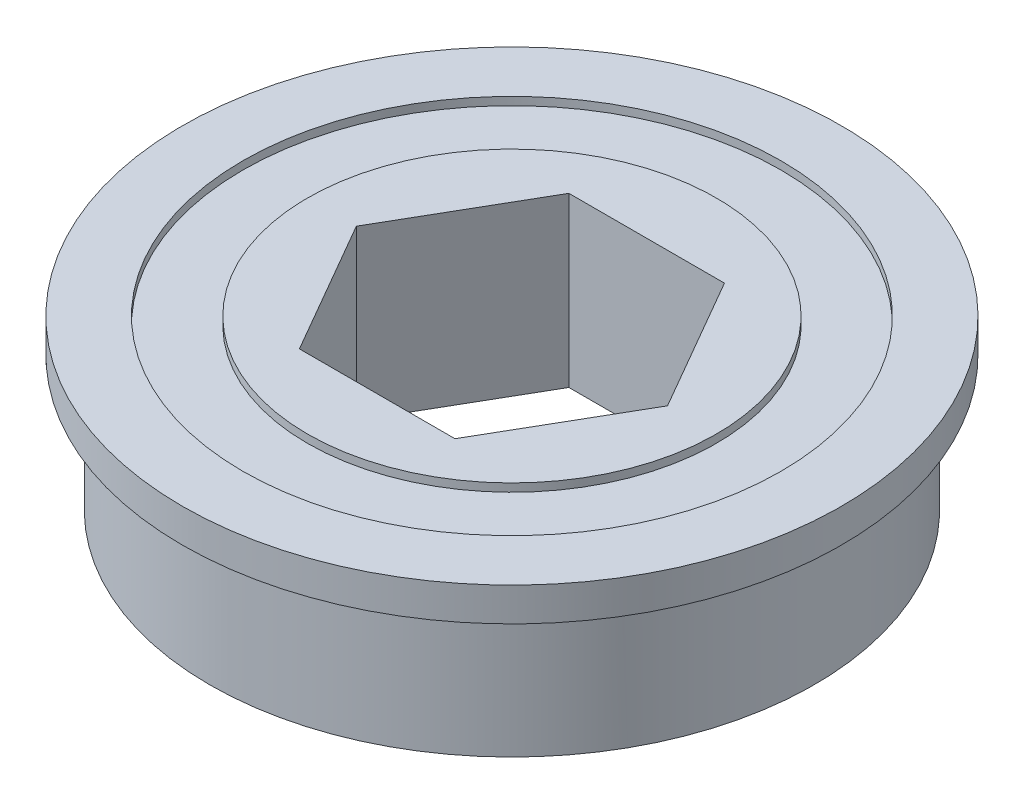
ISO-10303-21;
HEADER;
FILE_DESCRIPTION(('STEP AP214'),'2;1');
FILE_NAME('part.step','',(''),(''),'','','');
FILE_SCHEMA(('AUTOMOTIVE_DESIGN { 1 0 10303 214 1 1 1 1 }'));
ENDSEC;
DATA;
#1=APPLICATION_CONTEXT('core data for automotive mechanical design processes');
#2=APPLICATION_PROTOCOL_DEFINITION('international standard','automotive_design',2000,#1);
#3=PRODUCT_CONTEXT('',#1,'mechanical');
#4=PRODUCT('Part','Part','',(#3));
#5=PRODUCT_RELATED_PRODUCT_CATEGORY('part','',(#4));
#6=PRODUCT_DEFINITION_FORMATION('','',#4);
#7=PRODUCT_DEFINITION_CONTEXT('part definition',#1,'design');
#8=PRODUCT_DEFINITION('design','',#6,#7);
#9=PRODUCT_DEFINITION_SHAPE('','',#8);
#10=(LENGTH_UNIT() NAMED_UNIT(*) SI_UNIT(.MILLI.,.METRE.));
#11=(NAMED_UNIT(*) PLANE_ANGLE_UNIT() SI_UNIT($,.RADIAN.));
#12=(NAMED_UNIT(*) SI_UNIT($,.STERADIAN.) SOLID_ANGLE_UNIT());
#13=UNCERTAINTY_MEASURE_WITH_UNIT(LENGTH_MEASURE(1.E-05),#10,'distance_accuracy_value','');
#14=(GEOMETRIC_REPRESENTATION_CONTEXT(3) GLOBAL_UNCERTAINTY_ASSIGNED_CONTEXT((#13)) GLOBAL_UNIT_ASSIGNED_CONTEXT((#10,
#11,#12)) REPRESENTATION_CONTEXT('',''));
#15=CARTESIAN_POINT('',(0.,0.,0.));
#16=DIRECTION('',(0.,0.,1.));
#17=DIRECTION('',(1.,0.,0.));
#18=AXIS2_PLACEMENT_3D('',#15,#16,#17);
#19=CARTESIAN_POINT('',(0.,0.,0.));
#20=DIRECTION('',(0.,1.,0.));
#21=DIRECTION('',(0.,0.,1.));
#22=AXIS2_PLACEMENT_3D('',#19,#20,#21);
#23=CYLINDRICAL_SURFACE('',#22,12.7);
#24=CARTESIAN_POINT('',(0.,0.381,0.));
#25=DIRECTION('',(0.,1.,0.));
#26=DIRECTION('',(0.,0.,1.));
#27=AXIS2_PLACEMENT_3D('',#24,#25,#26);
#28=CIRCLE('',#27,12.7);
#29=CARTESIAN_POINT('',(0.,0.381,12.7));
#30=VERTEX_POINT('',#29);
#31=EDGE_CURVE('E180',#30,#30,#28,.F.);
#32=ORIENTED_EDGE('',*,*,#31,.F.);
#33=EDGE_LOOP('',(#32));
#34=FACE_BOUND('',#33,.T.);
#35=CARTESIAN_POINT('',(0.,0.,0.));
#36=DIRECTION('',(0.,1.,0.));
#37=DIRECTION('',(0.,0.,1.));
#38=AXIS2_PLACEMENT_3D('',#35,#36,#37);
#39=CIRCLE('',#38,12.7);
#40=CARTESIAN_POINT('',(0.,0.,12.7));
#41=VERTEX_POINT('',#40);
#42=EDGE_CURVE('E172',#41,#41,#39,.T.);
#43=ORIENTED_EDGE('',*,*,#42,.F.);
#44=EDGE_LOOP('',(#43));
#45=FACE_BOUND('',#44,.T.);
#46=ADVANCED_FACE('F19',(#34,#45),#23,.F.);
#47=CARTESIAN_POINT('',(9.652,0.381,0.));
#48=DIRECTION('',(0.,-1.,0.));
#49=DIRECTION('',(0.,0.,-1.));
#50=AXIS2_PLACEMENT_3D('',#47,#48,#49);
#51=PLANE('',#50);
#52=ORIENTED_EDGE('',*,*,#31,.T.);
#53=EDGE_LOOP('',(#52));
#54=FACE_BOUND('',#53,.T.);
#55=CARTESIAN_POINT('',(0.,0.381,0.));
#56=DIRECTION('',(0.,1.,0.));
#57=DIRECTION('',(0.,0.,1.));
#58=AXIS2_PLACEMENT_3D('',#55,#56,#57);
#59=CIRCLE('',#58,9.652);
#60=CARTESIAN_POINT('',(0.,0.381,9.652));
#61=VERTEX_POINT('',#60);
#62=EDGE_CURVE('E169',#61,#61,#59,.F.);
#63=ORIENTED_EDGE('',*,*,#62,.F.);
#64=EDGE_LOOP('',(#63));
#65=FACE_BOUND('',#64,.T.);
#66=ADVANCED_FACE('F261',(#54,#65),#51,.T.);
#67=CARTESIAN_POINT('',(14.2748,0.,0.));
#68=DIRECTION('',(0.,-1.,0.));
#69=DIRECTION('',(0.,0.,-1.));
#70=AXIS2_PLACEMENT_3D('',#67,#68,#69);
#71=PLANE('',#70);
#72=CARTESIAN_POINT('',(0.,0.,0.));
#73=DIRECTION('',(0.,1.,0.));
#74=DIRECTION('',(0.,0.,1.));
#75=AXIS2_PLACEMENT_3D('',#72,#73,#74);
#76=CIRCLE('',#75,14.2748);
#77=CARTESIAN_POINT('',(0.,0.,14.2748));
#78=VERTEX_POINT('',#77);
#79=EDGE_CURVE('E166',#78,#78,#76,.T.);
#80=ORIENTED_EDGE('',*,*,#79,.F.);
#81=EDGE_LOOP('',(#80));
#82=FACE_BOUND('',#81,.T.);
#83=ORIENTED_EDGE('',*,*,#42,.T.);
#84=EDGE_LOOP('',(#83));
#85=FACE_BOUND('',#84,.T.);
#86=ADVANCED_FACE('F259',(#82,#85),#71,.T.);
#87=CARTESIAN_POINT('',(0.,0.,0.));
#88=DIRECTION('',(0.,1.,0.));
#89=DIRECTION('',(0.,0.,1.));
#90=AXIS2_PLACEMENT_3D('',#87,#88,#89);
#91=CYLINDRICAL_SURFACE('',#90,9.652);
#92=CARTESIAN_POINT('',(0.,0.,0.));
#93=DIRECTION('',(0.,1.,0.));
#94=DIRECTION('',(0.,0.,1.));
#95=AXIS2_PLACEMENT_3D('',#92,#93,#94);
#96=CIRCLE('',#95,9.652);
#97=CARTESIAN_POINT('',(0.,0.,9.652));
#98=VERTEX_POINT('',#97);
#99=EDGE_CURVE('E163',#98,#98,#96,.F.);
#100=ORIENTED_EDGE('',*,*,#99,.F.);
#101=EDGE_LOOP('',(#100));
#102=FACE_BOUND('',#101,.T.);
#103=ORIENTED_EDGE('',*,*,#62,.T.);
#104=EDGE_LOOP('',(#103));
#105=FACE_BOUND('',#104,.T.);
#106=ADVANCED_FACE('F252',(#102,#105),#91,.T.);
#107=CARTESIAN_POINT('',(0.,0.,0.));
#108=DIRECTION('',(0.,1.,0.));
#109=DIRECTION('',(0.,0.,1.));
#110=AXIS2_PLACEMENT_3D('',#107,#108,#109);
#111=CYLINDRICAL_SURFACE('',#110,14.2748);
#112=ORIENTED_EDGE('',*,*,#79,.T.);
#113=EDGE_LOOP('',(#112));
#114=FACE_BOUND('',#113,.T.);
#115=CARTESIAN_POINT('',(0.,5.6,0.));
#116=DIRECTION('',(0.,-1.,0.));
#117=DIRECTION('',(0.,0.,-1.));
#118=AXIS2_PLACEMENT_3D('',#115,#116,#117);
#119=CIRCLE('',#118,14.2748);
#120=CARTESIAN_POINT('',(0.,5.6,-14.2748));
#121=VERTEX_POINT('',#120);
#122=EDGE_CURVE('E84',#121,#121,#119,.F.);
#123=ORIENTED_EDGE('',*,*,#122,.F.);
#124=EDGE_LOOP('',(#123));
#125=FACE_BOUND('',#124,.T.);
#126=ADVANCED_FACE('F248',(#114,#125),#111,.T.);
#127=CARTESIAN_POINT('',(9.652,0.,0.));
#128=DIRECTION('',(0.,-1.,0.));
#129=DIRECTION('',(0.,0.,-1.));
#130=AXIS2_PLACEMENT_3D('',#127,#128,#129);
#131=PLANE('',#130);
#132=ORIENTED_EDGE('',*,*,#99,.T.);
#133=EDGE_LOOP('',(#132));
#134=FACE_BOUND('',#133,.T.);
#135=DIRECTION('',(1.,0.,0.));
#136=VECTOR('',#135,1.);
#137=CARTESIAN_POINT('',(-3.67194771204601,0.,6.36));
#138=LINE('',#137,#136);
#139=CARTESIAN_POINT('',(-3.67194771204601,0.,6.36));
#140=VERTEX_POINT('',#139);
#141=CARTESIAN_POINT('',(3.67194771204602,0.,6.36));
#142=VERTEX_POINT('',#141);
#143=EDGE_CURVE('E63',#140,#142,#138,.T.);
#144=ORIENTED_EDGE('',*,*,#143,.T.);
#145=DIRECTION('',(0.5,0.,-0.866025403784439));
#146=VECTOR('',#145,1.);
#147=CARTESIAN_POINT('',(3.67194771204602,0.,6.36));
#148=LINE('',#147,#146);
#149=CARTESIAN_POINT('',(7.34389542409204,0.,0.));
#150=VERTEX_POINT('',#149);
#151=EDGE_CURVE('E67',#142,#150,#148,.T.);
#152=ORIENTED_EDGE('',*,*,#151,.T.);
#153=DIRECTION('',(-0.5,0.,-0.866025403784439));
#154=VECTOR('',#153,1.);
#155=CARTESIAN_POINT('',(7.34389542409204,0.,0.));
#156=LINE('',#155,#154);
#157=CARTESIAN_POINT('',(3.67194771204602,0.,-6.36));
#158=VERTEX_POINT('',#157);
#159=EDGE_CURVE('E66',#150,#158,#156,.T.);
#160=ORIENTED_EDGE('',*,*,#159,.T.);
#161=DIRECTION('',(-1.,0.,0.));
#162=VECTOR('',#161,1.);
#163=CARTESIAN_POINT('',(3.67194771204602,0.,-6.36));
#164=LINE('',#163,#162);
#165=CARTESIAN_POINT('',(-3.67194771204602,0.,-6.36));
#166=VERTEX_POINT('',#165);
#167=EDGE_CURVE('E108',#158,#166,#164,.T.);
#168=ORIENTED_EDGE('',*,*,#167,.T.);
#169=DIRECTION('',(-0.5,0.,0.866025403784439));
#170=VECTOR('',#169,1.);
#171=CARTESIAN_POINT('',(-3.67194771204602,0.,-6.36));
#172=LINE('',#171,#170);
#173=CARTESIAN_POINT('',(-7.34389542409204,0.,0.));
#174=VERTEX_POINT('',#173);
#175=EDGE_CURVE('E120',#166,#174,#172,.T.);
#176=ORIENTED_EDGE('',*,*,#175,.T.);
#177=DIRECTION('',(0.5,0.,0.866025403784439));
#178=VECTOR('',#177,1.);
#179=CARTESIAN_POINT('',(-7.34389542409204,0.,0.));
#180=LINE('',#179,#178);
#181=EDGE_CURVE('E124',#174,#140,#180,.T.);
#182=ORIENTED_EDGE('',*,*,#181,.T.);
#183=EDGE_LOOP('',(#144,#152,#160,#168,#176,#182));
#184=FACE_BOUND('',#183,.T.);
#185=ADVANCED_FACE('F69',(#134,#184),#131,.T.);
#186=CARTESIAN_POINT('',(0.,5.6,0.));
#187=DIRECTION('',(0.,-1.,0.));
#188=DIRECTION('',(0.,0.,-1.));
#189=AXIS2_PLACEMENT_3D('',#186,#187,#188);
#190=CONICAL_SURFACE('',#189,14.2748,0.523598775598298);
#191=CARTESIAN_POINT('',(0.,5.975,0.));
#192=DIRECTION('',(0.,1.,0.));
#193=DIRECTION('',(0.,0.,1.));
#194=AXIS2_PLACEMENT_3D('',#191,#192,#193);
#195=CIRCLE('',#194,14.0582936490539);
#196=CARTESIAN_POINT('',(0.,5.975,14.0582936490539));
#197=VERTEX_POINT('',#196);
#198=EDGE_CURVE('E299',#197,#197,#195,.F.);
#199=ORIENTED_EDGE('',*,*,#198,.T.);
#200=EDGE_LOOP('',(#199));
#201=FACE_BOUND('',#200,.T.);
#202=ORIENTED_EDGE('',*,*,#122,.T.);
#203=EDGE_LOOP('',(#202));
#204=FACE_BOUND('',#203,.T.);
#205=ADVANCED_FACE('F243',(#201,#204),#190,.T.);
#206=CARTESIAN_POINT('',(7.34389542409204,0.,0.));
#207=DIRECTION('',(0.866025403784439,0.,-0.5));
#208=DIRECTION('',(-0.5,0.,-0.866025403784439));
#209=AXIS2_PLACEMENT_3D('',#206,#207,#208);
#210=PLANE('',#209);
#211=DIRECTION('',(0.,1.,0.));
#212=VECTOR('',#211,1.);
#213=CARTESIAN_POINT('',(3.67194771204602,0.,-6.36));
#214=LINE('',#213,#212);
#215=CARTESIAN_POINT('',(3.67194771204602,7.9375,-6.36));
#216=VERTEX_POINT('',#215);
#217=EDGE_CURVE('E82',#216,#158,#214,.F.);
#218=ORIENTED_EDGE('',*,*,#217,.T.);
#219=ORIENTED_EDGE('',*,*,#159,.F.);
#220=DIRECTION('',(0.,1.,0.));
#221=VECTOR('',#220,1.);
#222=CARTESIAN_POINT('',(7.34389542409204,0.,0.));
#223=LINE('',#222,#221);
#224=CARTESIAN_POINT('',(7.34389542409204,7.9375,0.));
#225=VERTEX_POINT('',#224);
#226=EDGE_CURVE('E74',#150,#225,#223,.T.);
#227=ORIENTED_EDGE('',*,*,#226,.T.);
#228=DIRECTION('',(0.5,0.,0.866025403784438));
#229=VECTOR('',#228,1.);
#230=CARTESIAN_POINT('',(3.67194771204602,7.9375,-6.36));
#231=LINE('',#230,#229);
#232=EDGE_CURVE('E298',#216,#225,#231,.T.);
#233=ORIENTED_EDGE('',*,*,#232,.F.);
#234=EDGE_LOOP('',(#218,#219,#227,#233));
#235=FACE_BOUND('',#234,.T.);
#236=ADVANCED_FACE('F76',(#235),#210,.F.);
#237=CARTESIAN_POINT('',(3.67194771204602,0.,6.36));
#238=DIRECTION('',(0.866025403784439,0.,0.5));
#239=DIRECTION('',(0.5,0.,-0.866025403784439));
#240=AXIS2_PLACEMENT_3D('',#237,#238,#239);
#241=PLANE('',#240);
#242=ORIENTED_EDGE('',*,*,#226,.F.);
#243=ORIENTED_EDGE('',*,*,#151,.F.);
#244=DIRECTION('',(0.,1.,0.));
#245=VECTOR('',#244,1.);
#246=CARTESIAN_POINT('',(3.67194771204602,0.,6.36));
#247=LINE('',#246,#245);
#248=CARTESIAN_POINT('',(3.67194771204602,7.9375,6.36));
#249=VERTEX_POINT('',#248);
#250=EDGE_CURVE('E92',#142,#249,#247,.T.);
#251=ORIENTED_EDGE('',*,*,#250,.T.);
#252=DIRECTION('',(-0.5,0.,0.866025403784439));
#253=VECTOR('',#252,1.);
#254=CARTESIAN_POINT('',(7.34389542409204,7.9375,0.));
#255=LINE('',#254,#253);
#256=EDGE_CURVE('E86',#225,#249,#255,.T.);
#257=ORIENTED_EDGE('',*,*,#256,.F.);
#258=EDGE_LOOP('',(#242,#243,#251,#257));
#259=FACE_BOUND('',#258,.T.);
#260=ADVANCED_FACE('F89',(#259),#241,.F.);
#261=CARTESIAN_POINT('',(-3.67194771204601,0.,6.36));
#262=DIRECTION('',(0.,0.,1.));
#263=DIRECTION('',(1.,0.,0.));
#264=AXIS2_PLACEMENT_3D('',#261,#262,#263);
#265=PLANE('',#264);
#266=ORIENTED_EDGE('',*,*,#250,.F.);
#267=ORIENTED_EDGE('',*,*,#143,.F.);
#268=DIRECTION('',(0.,1.,0.));
#269=VECTOR('',#268,1.);
#270=CARTESIAN_POINT('',(-3.67194771204601,0.,6.36));
#271=LINE('',#270,#269);
#272=CARTESIAN_POINT('',(-3.67194771204601,7.9375,6.36));
#273=VERTEX_POINT('',#272);
#274=EDGE_CURVE('E118',#140,#273,#271,.T.);
#275=ORIENTED_EDGE('',*,*,#274,.T.);
#276=DIRECTION('',(1.,0.,0.));
#277=VECTOR('',#276,1.);
#278=CARTESIAN_POINT('',(6.35,7.9375,6.36));
#279=LINE('',#278,#277);
#280=EDGE_CURVE('E141',#249,#273,#279,.F.);
#281=ORIENTED_EDGE('',*,*,#280,.F.);
#282=EDGE_LOOP('',(#266,#267,#275,#281));
#283=FACE_BOUND('',#282,.T.);
#284=ADVANCED_FACE('F234',(#283),#265,.F.);
#285=CARTESIAN_POINT('',(-7.34389542409204,0.,0.));
#286=DIRECTION('',(-0.866025403784439,0.,0.5));
#287=DIRECTION('',(0.5,0.,0.866025403784439));
#288=AXIS2_PLACEMENT_3D('',#285,#286,#287);
#289=PLANE('',#288);
#290=ORIENTED_EDGE('',*,*,#274,.F.);
#291=ORIENTED_EDGE('',*,*,#181,.F.);
#292=DIRECTION('',(0.,1.,0.));
#293=VECTOR('',#292,1.);
#294=CARTESIAN_POINT('',(-7.34389542409204,0.,0.));
#295=LINE('',#294,#293);
#296=CARTESIAN_POINT('',(-7.34389542409204,7.9375,0.));
#297=VERTEX_POINT('',#296);
#298=EDGE_CURVE('E114',#174,#297,#295,.T.);
#299=ORIENTED_EDGE('',*,*,#298,.T.);
#300=DIRECTION('',(-0.5,0.,-0.866025403784439));
#301=VECTOR('',#300,1.);
#302=CARTESIAN_POINT('',(-3.67194771204601,7.9375,6.36));
#303=LINE('',#302,#301);
#304=EDGE_CURVE('E134',#273,#297,#303,.T.);
#305=ORIENTED_EDGE('',*,*,#304,.F.);
#306=EDGE_LOOP('',(#290,#291,#299,#305));
#307=FACE_BOUND('',#306,.T.);
#308=ADVANCED_FACE('F231',(#307),#289,.F.);
#309=CARTESIAN_POINT('',(-3.67194771204602,0.,-6.36));
#310=DIRECTION('',(-0.866025403784439,0.,-0.5));
#311=DIRECTION('',(-0.5,0.,0.866025403784439));
#312=AXIS2_PLACEMENT_3D('',#309,#310,#311);
#313=PLANE('',#312);
#314=ORIENTED_EDGE('',*,*,#298,.F.);
#315=ORIENTED_EDGE('',*,*,#175,.F.);
#316=DIRECTION('',(0.,1.,0.));
#317=VECTOR('',#316,1.);
#318=CARTESIAN_POINT('',(-3.67194771204602,0.,-6.36));
#319=LINE('',#318,#317);
#320=CARTESIAN_POINT('',(-3.67194771204602,7.9375,-6.36));
#321=VERTEX_POINT('',#320);
#322=EDGE_CURVE('E115',#166,#321,#319,.T.);
#323=ORIENTED_EDGE('',*,*,#322,.T.);
#324=DIRECTION('',(0.5,0.,-0.866025403784439));
#325=VECTOR('',#324,1.);
#326=CARTESIAN_POINT('',(-7.34389542409204,7.9375,0.));
#327=LINE('',#326,#325);
#328=EDGE_CURVE('E128',#297,#321,#327,.T.);
#329=ORIENTED_EDGE('',*,*,#328,.F.);
#330=EDGE_LOOP('',(#314,#315,#323,#329));
#331=FACE_BOUND('',#330,.T.);
#332=ADVANCED_FACE('F230',(#331),#313,.F.);
#333=CARTESIAN_POINT('',(3.67194771204602,0.,-6.36));
#334=DIRECTION('',(0.,0.,-1.));
#335=DIRECTION('',(-1.,0.,0.));
#336=AXIS2_PLACEMENT_3D('',#333,#334,#335);
#337=PLANE('',#336);
#338=ORIENTED_EDGE('',*,*,#322,.F.);
#339=ORIENTED_EDGE('',*,*,#167,.F.);
#340=ORIENTED_EDGE('',*,*,#217,.F.);
#341=DIRECTION('',(1.,0.,0.));
#342=VECTOR('',#341,1.);
#343=CARTESIAN_POINT('',(6.35,7.9375,-6.36));
#344=LINE('',#343,#342);
#345=EDGE_CURVE('E132',#321,#216,#344,.T.);
#346=ORIENTED_EDGE('',*,*,#345,.F.);
#347=EDGE_LOOP('',(#338,#339,#340,#346));
#348=FACE_BOUND('',#347,.T.);
#349=ADVANCED_FACE('F223',(#348),#337,.F.);
#350=CARTESIAN_POINT('',(6.35,7.9375,0.));
#351=DIRECTION('',(0.,1.,0.));
#352=DIRECTION('',(0.,0.,1.));
#353=AXIS2_PLACEMENT_3D('',#350,#351,#352);
#354=PLANE('',#353);
#355=CARTESIAN_POINT('',(0.,7.9375,0.));
#356=DIRECTION('',(0.,1.,0.));
#357=DIRECTION('',(0.,0.,1.));
#358=AXIS2_PLACEMENT_3D('',#355,#356,#357);
#359=CIRCLE('',#358,9.652);
#360=CARTESIAN_POINT('',(0.,7.9375,9.652));
#361=VERTEX_POINT('',#360);
#362=EDGE_CURVE('E159',#361,#361,#359,.F.);
#363=ORIENTED_EDGE('',*,*,#362,.F.);
#364=EDGE_LOOP('',(#363));
#365=FACE_BOUND('',#364,.T.);
#366=ORIENTED_EDGE('',*,*,#328,.T.);
#367=ORIENTED_EDGE('',*,*,#345,.T.);
#368=ORIENTED_EDGE('',*,*,#232,.T.);
#369=ORIENTED_EDGE('',*,*,#256,.T.);
#370=ORIENTED_EDGE('',*,*,#280,.T.);
#371=ORIENTED_EDGE('',*,*,#304,.T.);
#372=EDGE_LOOP('',(#366,#367,#368,#369,#370,#371));
#373=FACE_BOUND('',#372,.T.);
#374=ADVANCED_FACE('F213',(#365,#373),#354,.T.);
#375=CARTESIAN_POINT('',(0.,6.1,0.));
#376=DIRECTION('',(0.,1.,0.));
#377=DIRECTION('',(0.,0.,1.));
#378=AXIS2_PLACEMENT_3D('',#375,#376,#377);
#379=TOROIDAL_SURFACE('',#378,14.2748,0.25);
#380=ORIENTED_EDGE('',*,*,#198,.F.);
#381=EDGE_LOOP('',(#380));
#382=FACE_BOUND('',#381,.T.);
#383=CARTESIAN_POINT('',(0.,6.35,0.));
#384=DIRECTION('',(0.,-1.,0.));
#385=DIRECTION('',(0.,0.,-1.));
#386=AXIS2_PLACEMENT_3D('',#383,#384,#385);
#387=CIRCLE('',#386,14.2748);
#388=CARTESIAN_POINT('',(0.,6.35,14.2748));
#389=VERTEX_POINT('',#388);
#390=CARTESIAN_POINT('',(0.,6.35,-14.2748));
#391=VERTEX_POINT('',#390);
#392=EDGE_CURVE('E165',#389,#391,#387,.F.);
#393=ORIENTED_EDGE('',*,*,#392,.F.);
#394=CARTESIAN_POINT('',(0.,6.35,0.));
#395=DIRECTION('',(0.,-1.,0.));
#396=DIRECTION('',(0.,0.,1.));
#397=AXIS2_PLACEMENT_3D('',#394,#395,#396);
#398=CIRCLE('',#397,14.2748);
#399=EDGE_CURVE('E36',#391,#389,#398,.F.);
#400=ORIENTED_EDGE('',*,*,#399,.F.);
#401=EDGE_LOOP('',(#393,#400));
#402=FACE_BOUND('',#401,.T.);
#403=ADVANCED_FACE('F176',(#382,#402),#379,.F.);
#404=CARTESIAN_POINT('',(0.,0.,0.));
#405=DIRECTION('',(0.,1.,0.));
#406=DIRECTION('',(0.,0.,1.));
#407=AXIS2_PLACEMENT_3D('',#404,#405,#406);
#408=CYLINDRICAL_SURFACE('',#407,9.652);
#409=CARTESIAN_POINT('',(0.,7.5565,0.));
#410=DIRECTION('',(0.,1.,0.));
#411=DIRECTION('',(0.,0.,1.));
#412=AXIS2_PLACEMENT_3D('',#409,#410,#411);
#413=CIRCLE('',#412,9.652);
#414=CARTESIAN_POINT('',(0.,7.5565,9.652));
#415=VERTEX_POINT('',#414);
#416=EDGE_CURVE('E155',#415,#415,#413,.F.);
#417=ORIENTED_EDGE('',*,*,#416,.F.);
#418=EDGE_LOOP('',(#417));
#419=FACE_BOUND('',#418,.T.);
#420=ORIENTED_EDGE('',*,*,#362,.T.);
#421=EDGE_LOOP('',(#420));
#422=FACE_BOUND('',#421,.T.);
#423=ADVANCED_FACE('F205',(#419,#422),#408,.T.);
#424=CARTESIAN_POINT('',(15.5575,6.35,0.));
#425=DIRECTION('',(0.,-1.,0.));
#426=DIRECTION('',(0.,0.,-1.));
#427=AXIS2_PLACEMENT_3D('',#424,#425,#426);
#428=PLANE('',#427);
#429=CARTESIAN_POINT('',(0.,6.35,0.));
#430=DIRECTION('',(0.,1.,0.));
#431=DIRECTION('',(0.,0.,1.));
#432=AXIS2_PLACEMENT_3D('',#429,#430,#431);
#433=CIRCLE('',#432,15.5575);
#434=CARTESIAN_POINT('',(0.,6.35,15.5575));
#435=VERTEX_POINT('',#434);
#436=EDGE_CURVE('E146',#435,#435,#433,.T.);
#437=ORIENTED_EDGE('',*,*,#436,.F.);
#438=EDGE_LOOP('',(#437));
#439=FACE_BOUND('',#438,.T.);
#440=ORIENTED_EDGE('',*,*,#392,.T.);
#441=ORIENTED_EDGE('',*,*,#399,.T.);
#442=EDGE_LOOP('',(#440,#441));
#443=FACE_BOUND('',#442,.T.);
#444=ADVANCED_FACE('F184',(#439,#443),#428,.T.);
#445=CARTESIAN_POINT('',(9.652,7.5565,0.));
#446=DIRECTION('',(0.,1.,0.));
#447=DIRECTION('',(0.,0.,1.));
#448=AXIS2_PLACEMENT_3D('',#445,#446,#447);
#449=PLANE('',#448);
#450=ORIENTED_EDGE('',*,*,#416,.T.);
#451=EDGE_LOOP('',(#450));
#452=FACE_BOUND('',#451,.T.);
#453=CARTESIAN_POINT('',(0.,7.5565,0.));
#454=DIRECTION('',(0.,1.,0.));
#455=DIRECTION('',(0.,0.,1.));
#456=AXIS2_PLACEMENT_3D('',#453,#454,#455);
#457=CIRCLE('',#456,12.7);
#458=CARTESIAN_POINT('',(0.,7.5565,12.7));
#459=VERTEX_POINT('',#458);
#460=EDGE_CURVE('E151',#459,#459,#457,.T.);
#461=ORIENTED_EDGE('',*,*,#460,.T.);
#462=EDGE_LOOP('',(#461));
#463=FACE_BOUND('',#462,.T.);
#464=ADVANCED_FACE('F201',(#452,#463),#449,.T.);
#465=CARTESIAN_POINT('',(0.,0.,0.));
#466=DIRECTION('',(0.,1.,0.));
#467=DIRECTION('',(0.,0.,1.));
#468=AXIS2_PLACEMENT_3D('',#465,#466,#467);
#469=CYLINDRICAL_SURFACE('',#468,15.5575);
#470=ORIENTED_EDGE('',*,*,#436,.T.);
#471=EDGE_LOOP('',(#470));
#472=FACE_BOUND('',#471,.T.);
#473=CARTESIAN_POINT('',(0.,7.9375,0.));
#474=DIRECTION('',(0.,1.,0.));
#475=DIRECTION('',(0.,0.,1.));
#476=AXIS2_PLACEMENT_3D('',#473,#474,#475);
#477=CIRCLE('',#476,15.5575);
#478=CARTESIAN_POINT('',(0.,7.9375,15.5575));
#479=VERTEX_POINT('',#478);
#480=EDGE_CURVE('E28',#479,#479,#477,.T.);
#481=ORIENTED_EDGE('',*,*,#480,.F.);
#482=EDGE_LOOP('',(#481));
#483=FACE_BOUND('',#482,.T.);
#484=ADVANCED_FACE('F279',(#472,#483),#469,.T.);
#485=CARTESIAN_POINT('',(0.,0.,0.));
#486=DIRECTION('',(0.,1.,0.));
#487=DIRECTION('',(0.,0.,1.));
#488=AXIS2_PLACEMENT_3D('',#485,#486,#487);
#489=CYLINDRICAL_SURFACE('',#488,12.7);
#490=CARTESIAN_POINT('',(0.,7.9375,0.));
#491=DIRECTION('',(0.,1.,0.));
#492=DIRECTION('',(0.,0.,1.));
#493=AXIS2_PLACEMENT_3D('',#490,#491,#492);
#494=CIRCLE('',#493,12.7);
#495=CARTESIAN_POINT('',(0.,7.9375,12.7));
#496=VERTEX_POINT('',#495);
#497=EDGE_CURVE('E12',#496,#496,#494,.F.);
#498=ORIENTED_EDGE('',*,*,#497,.F.);
#499=EDGE_LOOP('',(#498));
#500=FACE_BOUND('',#499,.T.);
#501=ORIENTED_EDGE('',*,*,#460,.F.);
#502=EDGE_LOOP('',(#501));
#503=FACE_BOUND('',#502,.T.);
#504=ADVANCED_FACE('F271',(#500,#503),#489,.F.);
#505=CARTESIAN_POINT('',(12.7,7.9375,0.));
#506=DIRECTION('',(0.,1.,0.));
#507=DIRECTION('',(0.,0.,1.));
#508=AXIS2_PLACEMENT_3D('',#505,#506,#507);
#509=PLANE('',#508);
#510=ORIENTED_EDGE('',*,*,#497,.T.);
#511=EDGE_LOOP('',(#510));
#512=FACE_BOUND('',#511,.T.);
#513=ORIENTED_EDGE('',*,*,#480,.T.);
#514=EDGE_LOOP('',(#513));
#515=FACE_BOUND('',#514,.T.);
#516=ADVANCED_FACE('F273',(#512,#515),#509,.T.);
#517=CLOSED_SHELL('',(#46,#66,#86,#106,#126,#185,#205,#236,#260,#284,#308,#332,#349,#374,#403,
#423,#444,#464,#484,#504,#516));
#518=MANIFOLD_SOLID_BREP('B1',#517);
#519=ADVANCED_BREP_SHAPE_REPRESENTATION('',(#18,#518),#14);
#520=SHAPE_DEFINITION_REPRESENTATION(#9,#519);
ENDSEC;
END-ISO-10303-21;
